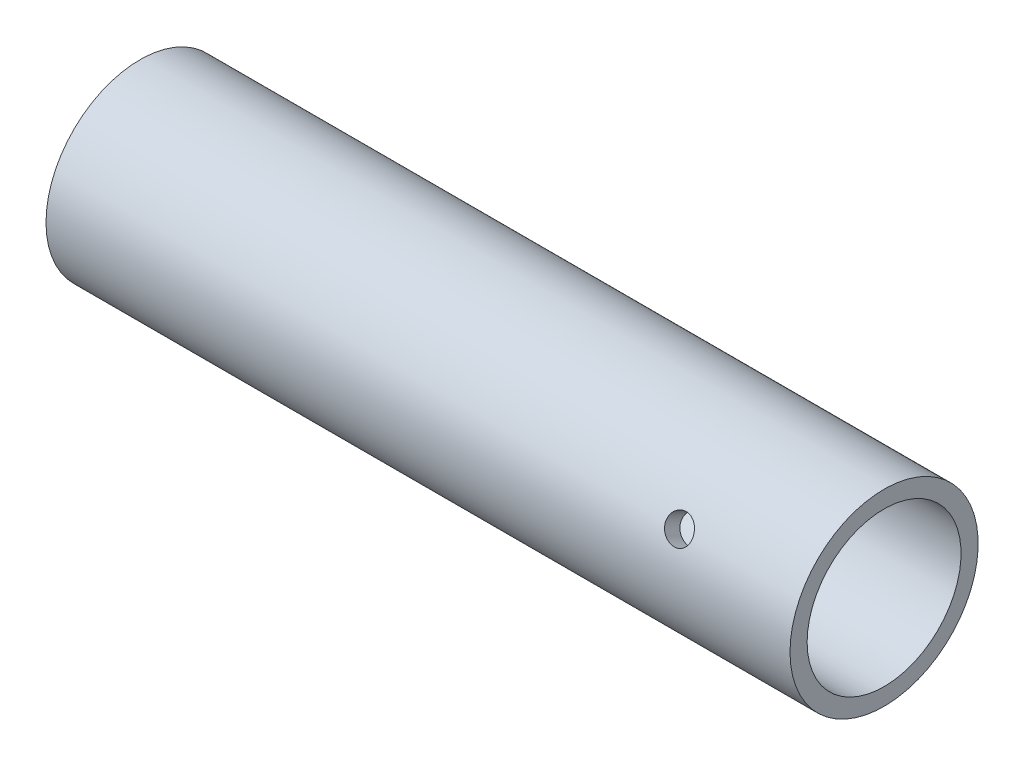
ISO-10303-21;
HEADER;
FILE_DESCRIPTION(('STEP AP214'),'2;1');
FILE_NAME('part.step','',(''),(''),'','','');
FILE_SCHEMA(('AUTOMOTIVE_DESIGN { 1 0 10303 214 1 1 1 1 }'));
ENDSEC;
DATA;
#1=APPLICATION_CONTEXT('core data for automotive mechanical design processes');
#2=APPLICATION_PROTOCOL_DEFINITION('international standard','automotive_design',2000,#1);
#3=PRODUCT_CONTEXT('',#1,'mechanical');
#4=PRODUCT('Part','Part','',(#3));
#5=PRODUCT_RELATED_PRODUCT_CATEGORY('part','',(#4));
#6=PRODUCT_DEFINITION_FORMATION('','',#4);
#7=PRODUCT_DEFINITION_CONTEXT('part definition',#1,'design');
#8=PRODUCT_DEFINITION('design','',#6,#7);
#9=PRODUCT_DEFINITION_SHAPE('','',#8);
#10=(LENGTH_UNIT() NAMED_UNIT(*) SI_UNIT(.MILLI.,.METRE.));
#11=(NAMED_UNIT(*) PLANE_ANGLE_UNIT() SI_UNIT($,.RADIAN.));
#12=(NAMED_UNIT(*) SI_UNIT($,.STERADIAN.) SOLID_ANGLE_UNIT());
#13=UNCERTAINTY_MEASURE_WITH_UNIT(LENGTH_MEASURE(1.E-05),#10,'distance_accuracy_value','');
#14=(GEOMETRIC_REPRESENTATION_CONTEXT(3) GLOBAL_UNCERTAINTY_ASSIGNED_CONTEXT((#13)) GLOBAL_UNIT_ASSIGNED_CONTEXT((#10,
#11,#12)) REPRESENTATION_CONTEXT('',''));
#15=CARTESIAN_POINT('',(0.,0.,0.));
#16=DIRECTION('',(0.,0.,1.));
#17=DIRECTION('',(1.,0.,0.));
#18=AXIS2_PLACEMENT_3D('',#15,#16,#17);
#19=CARTESIAN_POINT('',(261.558388757778,0.,0.));
#20=DIRECTION('',(-1.,0.,0.));
#21=DIRECTION('',(0.,0.,1.));
#22=AXIS2_PLACEMENT_3D('',#19,#20,#21);
#23=PLANE('',#22);
#24=CARTESIAN_POINT('',(261.558388757778,-148.573704322227,0.));
#25=DIRECTION('',(-1.,0.,0.));
#26=DIRECTION('',(0.,0.,1.));
#27=AXIS2_PLACEMENT_3D('',#24,#25,#26);
#28=CIRCLE('',#27,5.50000000000001);
#29=CARTESIAN_POINT('',(261.558388757778,-148.573704322227,5.50000000000001));
#30=VERTEX_POINT('',#29);
#31=EDGE_CURVE('E130',#30,#30,#28,.T.);
#32=ORIENTED_EDGE('',*,*,#31,.T.);
#33=EDGE_LOOP('',(#32));
#34=FACE_BOUND('',#33,.T.);
#35=CARTESIAN_POINT('',(261.558388757778,-148.573704322227,0.));
#36=DIRECTION('',(-1.,0.,0.));
#37=DIRECTION('',(0.,0.,1.));
#38=AXIS2_PLACEMENT_3D('',#35,#36,#37);
#39=CIRCLE('',#38,0.5);
#40=CARTESIAN_POINT('',(261.558388757778,-148.573704322227,0.5));
#41=VERTEX_POINT('',#40);
#42=EDGE_CURVE('E51',#41,#41,#39,.T.);
#43=ORIENTED_EDGE('',*,*,#42,.F.);
#44=EDGE_LOOP('',(#43));
#45=FACE_BOUND('',#44,.T.);
#46=ADVANCED_FACE('F39',(#34,#45),#23,.T.);
#47=CARTESIAN_POINT('',(263.058388757778,-148.573704322227,0.));
#48=DIRECTION('',(-1.,0.,0.));
#49=DIRECTION('',(0.,0.,1.));
#50=AXIS2_PLACEMENT_3D('',#47,#48,#49);
#51=CYLINDRICAL_SURFACE('',#50,0.5);
#52=ORIENTED_EDGE('',*,*,#42,.T.);
#53=EDGE_LOOP('',(#52));
#54=FACE_BOUND('',#53,.T.);
#55=CARTESIAN_POINT('',(263.058388757778,-148.573704322227,0.));
#56=DIRECTION('',(-1.,0.,0.));
#57=DIRECTION('',(0.,0.,1.));
#58=AXIS2_PLACEMENT_3D('',#55,#56,#57);
#59=CIRCLE('',#58,0.5);
#60=CARTESIAN_POINT('',(263.058388757778,-148.573704322227,0.5));
#61=VERTEX_POINT('',#60);
#62=EDGE_CURVE('E55',#61,#61,#59,.T.);
#63=ORIENTED_EDGE('',*,*,#62,.F.);
#64=EDGE_LOOP('',(#63));
#65=FACE_BOUND('',#64,.T.);
#66=ADVANCED_FACE('F102',(#54,#65),#51,.F.);
#67=CARTESIAN_POINT('',(263.058388757778,0.,0.));
#68=DIRECTION('',(-1.,0.,0.));
#69=DIRECTION('',(0.,0.,1.));
#70=AXIS2_PLACEMENT_3D('',#67,#68,#69);
#71=PLANE('',#70);
#72=CARTESIAN_POINT('',(263.058388757778,-148.573704322227,0.));
#73=DIRECTION('',(-1.,0.,0.));
#74=DIRECTION('',(0.,0.,1.));
#75=AXIS2_PLACEMENT_3D('',#72,#73,#74);
#76=CIRCLE('',#75,4.);
#77=CARTESIAN_POINT('',(263.058388757778,-148.573704322227,4.));
#78=VERTEX_POINT('',#77);
#79=EDGE_CURVE('E115',#78,#78,#76,.T.);
#80=ORIENTED_EDGE('',*,*,#79,.F.);
#81=EDGE_LOOP('',(#80));
#82=FACE_BOUND('',#81,.T.);
#83=ORIENTED_EDGE('',*,*,#62,.T.);
#84=EDGE_LOOP('',(#83));
#85=FACE_BOUND('',#84,.T.);
#86=ADVANCED_FACE('F99',(#82,#85),#71,.F.);
#87=CARTESIAN_POINT('',(263.058388757778,-148.573704322227,0.));
#88=DIRECTION('',(-1.,0.,0.));
#89=DIRECTION('',(0.,0.,1.));
#90=AXIS2_PLACEMENT_3D('',#87,#88,#89);
#91=CYLINDRICAL_SURFACE('',#90,4.);
#92=CARTESIAN_POINT('',(295.058388757778,-148.573704322227,0.));
#93=DIRECTION('',(-1.,0.,0.));
#94=DIRECTION('',(0.,0.,1.));
#95=AXIS2_PLACEMENT_3D('',#92,#93,#94);
#96=CIRCLE('',#95,4.);
#97=CARTESIAN_POINT('',(295.058388757778,-148.573704322227,4.));
#98=VERTEX_POINT('',#97);
#99=EDGE_CURVE('E117',#98,#98,#96,.T.);
#100=ORIENTED_EDGE('',*,*,#99,.F.);
#101=EDGE_LOOP('',(#100));
#102=FACE_BOUND('',#101,.T.);
#103=ORIENTED_EDGE('',*,*,#79,.T.);
#104=EDGE_LOOP('',(#103));
#105=FACE_BOUND('',#104,.T.);
#106=ADVANCED_FACE('F95',(#102,#105),#91,.F.);
#107=CARTESIAN_POINT('',(295.058388757778,0.,0.));
#108=DIRECTION('',(-1.,0.,0.));
#109=DIRECTION('',(0.,0.,1.));
#110=AXIS2_PLACEMENT_3D('',#107,#108,#109);
#111=PLANE('',#110);
#112=CARTESIAN_POINT('',(295.058388757778,-148.573704322227,0.));
#113=DIRECTION('',(-1.,0.,0.));
#114=DIRECTION('',(0.,0.,1.));
#115=AXIS2_PLACEMENT_3D('',#112,#113,#114);
#116=CIRCLE('',#115,4.5);
#117=CARTESIAN_POINT('',(295.058388757778,-148.573704322227,4.5));
#118=VERTEX_POINT('',#117);
#119=EDGE_CURVE('E122',#118,#118,#116,.T.);
#120=ORIENTED_EDGE('',*,*,#119,.F.);
#121=EDGE_LOOP('',(#120));
#122=FACE_BOUND('',#121,.T.);
#123=ORIENTED_EDGE('',*,*,#99,.T.);
#124=EDGE_LOOP('',(#123));
#125=FACE_BOUND('',#124,.T.);
#126=ADVANCED_FACE('F90',(#122,#125),#111,.F.);
#127=CARTESIAN_POINT('',(263.058388757778,-148.573704322227,0.));
#128=DIRECTION('',(-1.,0.,0.));
#129=DIRECTION('',(0.,0.,1.));
#130=AXIS2_PLACEMENT_3D('',#127,#128,#129);
#131=CYLINDRICAL_SURFACE('',#130,4.5);
#132=CARTESIAN_POINT('',(298.024345503325,-151.243901459257,-3.62216057752752));
#133=CARTESIAN_POINT('',(297.979791781199,-151.24390025775,-3.62216210114015));
#134=CARTESIAN_POINT('',(297.935214846293,-151.240848975225,-3.62441695078067));
#135=CARTESIAN_POINT('',(297.847314947584,-151.228706225954,-3.63332071635518));
#136=CARTESIAN_POINT('',(297.803993127388,-151.219609420882,-3.63997351574485));
#137=CARTESIAN_POINT('',(297.719888139272,-151.1955879936,-3.65731375261388));
#138=CARTESIAN_POINT('',(297.679102760693,-151.180668531109,-3.66799761770595));
#139=CARTESIAN_POINT('',(297.601151283677,-151.145327213935,-3.69286073185263));
#140=CARTESIAN_POINT('',(297.563984843519,-151.124905879459,-3.70703965043615));
#141=CARTESIAN_POINT('',(297.493906464566,-151.07875919164,-3.73837981269519));
#142=CARTESIAN_POINT('',(297.461040939221,-151.05298269161,-3.75556954366251));
#143=CARTESIAN_POINT('',(297.400901110786,-150.996807902518,-3.79205599158594));
#144=CARTESIAN_POINT('',(297.373627157271,-150.9664093247,-3.81135284015922));
#145=CARTESIAN_POINT('',(297.325268546323,-150.901449921466,-3.85137162004821));
#146=CARTESIAN_POINT('',(297.304227384086,-150.866862114511,-3.87210237565137));
#147=CARTESIAN_POINT('',(297.269211545301,-150.794536373949,-3.91403246064475));
#148=CARTESIAN_POINT('',(297.255236346423,-150.756798673429,-3.93523175527869));
#149=CARTESIAN_POINT('',(297.234891924187,-150.679577209402,-3.97708524162272));
#150=CARTESIAN_POINT('',(297.228444573471,-150.640115872607,-3.99774281701715));
#151=CARTESIAN_POINT('',(297.223095666577,-150.560184827746,-4.03805620880223));
#152=CARTESIAN_POINT('',(297.224193530125,-150.519715197464,-4.05771210211133));
#153=CARTESIAN_POINT('',(297.2338434835,-150.439408378284,-4.09525235934867));
#154=CARTESIAN_POINT('',(297.242311471016,-150.399569200209,-4.11315418364266));
#155=CARTESIAN_POINT('',(297.266328563301,-150.321234582551,-4.14704237490519));
#156=CARTESIAN_POINT('',(297.281877906336,-150.282739188229,-4.16302867739918));
#157=CARTESIAN_POINT('',(297.319698105475,-150.20804926549,-4.19291600356479));
#158=CARTESIAN_POINT('',(297.342003077499,-150.171867571577,-4.20680589404191));
#159=CARTESIAN_POINT('',(297.392676311863,-150.103119338446,-4.23228494524259));
#160=CARTESIAN_POINT('',(297.421045130568,-150.07055313137,-4.24387389466338));
#161=CARTESIAN_POINT('',(297.48350568974,-150.009629205228,-4.26487681986434));
#162=CARTESIAN_POINT('',(297.517670977981,-149.981335738339,-4.27425858713246));
#163=CARTESIAN_POINT('',(297.59050830587,-149.930441029379,-4.29068559718337));
#164=CARTESIAN_POINT('',(297.629180398978,-149.907839854841,-4.29773081224593));
#165=CARTESIAN_POINT('',(297.710023109109,-149.86909151628,-4.30956901037885));
#166=CARTESIAN_POINT('',(297.752198565268,-149.852953464854,-4.31435881512193));
#167=CARTESIAN_POINT('',(297.838800312918,-149.827778263383,-4.32174413454549));
#168=CARTESIAN_POINT('',(297.883226376477,-149.818740395784,-4.32433987096323));
#169=CARTESIAN_POINT('',(297.972422579292,-149.808186676732,-4.32736449058495));
#170=CARTESIAN_POINT('',(298.017179870536,-149.806570424851,-4.32782229738731));
#171=CARTESIAN_POINT('',(298.106331148763,-149.810648744704,-4.32665839042377));
#172=CARTESIAN_POINT('',(298.150725151722,-149.816342993225,-4.32503676859416));
#173=CARTESIAN_POINT('',(298.237556990384,-149.834754994651,-4.31970381148003));
#174=CARTESIAN_POINT('',(298.28000676118,-149.847421059303,-4.3160078511911));
#175=CARTESIAN_POINT('',(298.362125737379,-149.879279222477,-4.30647755916957));
#176=CARTESIAN_POINT('',(298.401794755925,-149.898471759048,-4.30064308390054));
#177=CARTESIAN_POINT('',(298.477681589769,-149.942951936677,-4.28668961722373));
#178=CARTESIAN_POINT('',(298.513859077217,-149.968301083657,-4.2785474247208));
#179=CARTESIAN_POINT('',(298.581317261664,-150.024143435527,-4.25994019733975));
#180=CARTESIAN_POINT('',(298.612597564331,-150.054637054251,-4.2494749755701));
#181=CARTESIAN_POINT('',(298.669753584928,-150.12018884189,-4.22606305444826));
#182=CARTESIAN_POINT('',(298.695560396243,-150.155297112135,-4.21308824852935));
#183=CARTESIAN_POINT('',(298.74055232718,-150.228676613403,-4.18480711142089));
#184=CARTESIAN_POINT('',(298.759737682938,-150.266947731573,-4.1695008634032));
#185=CARTESIAN_POINT('',(298.790836980022,-150.34526713958,-4.13682912458866));
#186=CARTESIAN_POINT('',(298.80278582338,-150.38530588353,-4.11947400825897));
#187=CARTESIAN_POINT('',(298.819184806013,-150.466102445717,-4.08298820350891));
#188=CARTESIAN_POINT('',(298.823635651249,-150.506860195892,-4.06385768242769));
#189=CARTESIAN_POINT('',(298.824889760393,-150.587312380045,-4.02459426092374));
#190=CARTESIAN_POINT('',(298.821797461379,-150.627013727896,-4.00447878533851));
#191=CARTESIAN_POINT('',(298.808280428933,-150.704812608853,-3.96362315781472));
#192=CARTESIAN_POINT('',(298.797855751076,-150.742910154114,-3.94288301061208));
#193=CARTESIAN_POINT('',(298.77001203419,-150.816444274091,-3.90152483193817));
#194=CARTESIAN_POINT('',(298.752603043849,-150.851884585331,-3.8809066680258));
#195=CARTESIAN_POINT('',(298.711296947326,-150.919305899099,-3.84053370907949));
#196=CARTESIAN_POINT('',(298.687399466409,-150.951286701679,-3.82077896398788));
#197=CARTESIAN_POINT('',(298.63343005709,-151.011456336885,-3.78267781118496));
#198=CARTESIAN_POINT('',(298.603282168731,-151.039590693144,-3.764352957311));
#199=CARTESIAN_POINT('',(298.537826318455,-151.09096155591,-3.73019705033898));
#200=CARTESIAN_POINT('',(298.502517148168,-151.11419691233,-3.71436658304057));
#201=CARTESIAN_POINT('',(298.427396412234,-151.155433223478,-3.6858257838361));
#202=CARTESIAN_POINT('',(298.387550367734,-151.17338978907,-3.6731420441212));
#203=CARTESIAN_POINT('',(298.304729692229,-151.203400640516,-3.65171741905032));
#204=CARTESIAN_POINT('',(298.261758144609,-151.21546065512,-3.6429727074143));
#205=CARTESIAN_POINT('',(298.186257265358,-151.230903956832,-3.63171471776848));
#206=CARTESIAN_POINT('',(298.154177563433,-151.235771853139,-3.62814178619092));
#207=CARTESIAN_POINT('',(298.089517875242,-151.242271007287,-3.62336418551826));
#208=CARTESIAN_POINT('',(298.056937900287,-151.243902338197,-3.62215946295875));
#209=CARTESIAN_POINT('',(298.024345503325,-151.243901459257,-3.62216057752752));
#210=B_SPLINE_CURVE_WITH_KNOTS('',3,(#132,#133,#134,#135,#136,#137,#138,#139,#140,#141,#142,
#143,#144,#145,#146,#147,#148,#149,#150,#151,#152,#153,#154,#155,#156,#157,#158,#159,#160,#161,
#162,#163,#164,#165,#166,#167,#168,#169,#170,#171,#172,#173,#174,#175,#176,#177,#178,#179,#180,
#181,#182,#183,#184,#185,#186,#187,#188,#189,#190,#191,#192,#193,#194,#195,#196,#197,#198,#199,
#200,#201,#202,#203,#204,#205,#206,#207,#208,#209),.UNSPECIFIED.,.T.,.F.,(4,2,2,2,2,2,2,2,2,2,2,
2,2,2,2,2,2,2,2,2,2,2,2,2,2,2,2,2,2,2,2,2,2,2,2,2,2,2,4),(0.,0.133541937414479,
0.267201952157879,0.40074379267473,0.534273011124951,0.669141576293385,0.80401857059909,
0.939815747099054,1.07560288373579,1.20996786915373,1.34432252118487,1.4771638273651,
1.61000960359648,1.74353776478289,1.87707818262098,2.0124607557353,2.14784493493399,
2.28341933092325,2.41898002383352,2.55270132678981,2.68641671782542,2.81915385613851,
2.95189990535771,3.0860310049729,3.22017289956884,3.35591462618018,3.49165151147587,
3.62672840692522,3.76179258373143,3.89499739667982,4.02820119999221,4.16121403952693,
4.29423456270357,4.42897790590449,4.5637528461869,4.6996306534586,4.83537618605278,
4.9330683628565,5.03075833414773),.UNSPECIFIED.);
#211=CARTESIAN_POINT('',(298.024345503325,-151.243901459257,-3.62216057752752));
#212=VERTEX_POINT('',#211);
#213=EDGE_CURVE('E80',#212,#212,#210,.T.);
#214=ORIENTED_EDGE('',*,*,#213,.T.);
#215=EDGE_LOOP('',(#214));
#216=FACE_BOUND('',#215,.T.);
#217=CARTESIAN_POINT('',(298.024345503325,-147.339654264115,4.32748431008969));
#218=CARTESIAN_POINT('',(298.06889922545,-147.339652323846,4.32748429070652));
#219=CARTESIAN_POINT('',(298.113476160356,-147.336002533499,4.32644809460398));
#220=CARTESIAN_POINT('',(298.201376059065,-147.321533016187,4.32228198490324));
#221=CARTESIAN_POINT('',(298.244697879261,-147.310706952443,4.31915022085724));
#222=CARTESIAN_POINT('',(298.328802867377,-147.282299156666,4.31074130163626));
#223=CARTESIAN_POINT('',(298.369588245956,-147.264723406056,4.30546604573649));
#224=CARTESIAN_POINT('',(298.447539722972,-147.223441930096,4.29269800410116));
#225=CARTESIAN_POINT('',(298.48470616313,-147.199736784294,4.28520542800853));
#226=CARTESIAN_POINT('',(298.554784542083,-147.146723809402,4.26784607720977));
#227=CARTESIAN_POINT('',(298.587650067428,-147.117362168289,4.25795624224106));
#228=CARTESIAN_POINT('',(298.647789895863,-147.054145992585,4.23580713524086));
#229=CARTESIAN_POINT('',(298.675063849378,-147.020291177307,4.22354771516079));
#230=CARTESIAN_POINT('',(298.723422460326,-146.94890922561,4.19660622700057));
#231=CARTESIAN_POINT('',(298.744463622563,-146.911358610987,4.18190820130683));
#232=CARTESIAN_POINT('',(298.779479461348,-146.833960761945,4.15030570553423));
#233=CARTESIAN_POINT('',(298.793454660226,-146.794113697526,4.13340139866427));
#234=CARTESIAN_POINT('',(298.813799082462,-146.713783502114,4.09787776525641));
#235=CARTESIAN_POINT('',(298.820246433178,-146.673311403788,4.07927825504744));
#236=CARTESIAN_POINT('',(298.825595340072,-146.592543505023,4.04066882590374));
#237=CARTESIAN_POINT('',(298.824497476524,-146.552247691265,4.02065901554701));
#238=CARTESIAN_POINT('',(298.814847523149,-146.473444630373,3.98005687626596));
#239=CARTESIAN_POINT('',(298.806379535633,-146.434922349628,3.95947364743754));
#240=CARTESIAN_POINT('',(298.782362443348,-146.360215100631,3.91819957836307));
#241=CARTESIAN_POINT('',(298.766813100313,-146.324030211071,3.89750873451924));
#242=CARTESIAN_POINT('',(298.728992901174,-146.25471726811,3.85667305450607));
#243=CARTESIAN_POINT('',(298.70668792915,-146.221605871419,3.83653156893396));
#244=CARTESIAN_POINT('',(298.656014694786,-146.159413895389,3.79770297475194));
#245=CARTESIAN_POINT('',(298.627645876081,-146.130333686319,3.7790159998101));
#246=CARTESIAN_POINT('',(298.565185316909,-146.076467296293,3.74364285082579));
#247=CARTESIAN_POINT('',(298.531020028668,-146.051745884148,3.72698783334538));
#248=CARTESIAN_POINT('',(298.458182700779,-146.007632005243,3.69675401540545));
#249=CARTESIAN_POINT('',(298.419510607671,-145.988239601703,3.68317525144237));
#250=CARTESIAN_POINT('',(298.338667897541,-145.955182745778,3.65974832350551));
#251=CARTESIAN_POINT('',(298.296492441381,-145.94152637953,3.64990542788573));
#252=CARTESIAN_POINT('',(298.209890693731,-145.920291216801,3.63449758650598));
#253=CARTESIAN_POINT('',(298.165464630172,-145.912711806174,3.62893220845604));
#254=CARTESIAN_POINT('',(298.076268427357,-145.90386628746,3.62242943148281));
#255=CARTESIAN_POINT('',(298.031511136113,-145.902515911166,3.62143026128845));
#256=CARTESIAN_POINT('',(297.942359857886,-145.905930238048,3.6239461595755));
#257=CARTESIAN_POINT('',(297.897965854927,-145.910694670873,3.62746102848093));
#258=CARTESIAN_POINT('',(297.811134016265,-145.926171031835,3.63877139892073));
#259=CARTESIAN_POINT('',(297.768684245469,-145.936839193493,3.64653539551156));
#260=CARTESIAN_POINT('',(297.686565269271,-145.963857393522,3.6659205933196));
#261=CARTESIAN_POINT('',(297.646896250724,-145.980207813281,3.6775420534436));
#262=CARTESIAN_POINT('',(297.57100941688,-146.018442738012,3.70421181094224));
#263=CARTESIAN_POINT('',(297.534831929432,-146.04038320473,3.71929459820259));
#264=CARTESIAN_POINT('',(297.467373744985,-146.089247138249,3.75211095348777));
#265=CARTESIAN_POINT('',(297.436093442318,-146.116171005944,3.76984473475191));
#266=CARTESIAN_POINT('',(297.378937421721,-146.174773002231,3.80740749482772));
#267=CARTESIAN_POINT('',(297.353130610406,-146.20650400248,3.82725893939429));
#268=CARTESIAN_POINT('',(297.308138679469,-146.273744745487,3.86803952794201));
#269=CARTESIAN_POINT('',(297.288953323711,-146.309254353434,3.88896863346106));
#270=CARTESIAN_POINT('',(297.257854026627,-146.382989644886,3.93097433524505));
#271=CARTESIAN_POINT('',(297.245905183269,-146.421201282582,3.95204971956997));
#272=CARTESIAN_POINT('',(297.229506200636,-146.49946928624,3.99368405651498));
#273=CARTESIAN_POINT('',(297.2250553554,-146.539525478166,4.01424305757468));
#274=CARTESIAN_POINT('',(297.223801246256,-146.619781060647,4.05390679017464));
#275=CARTESIAN_POINT('',(297.22689354527,-146.659970888521,4.07302764566471));
#276=CARTESIAN_POINT('',(297.240410577716,-146.739864411808,4.10961826079321));
#277=CARTESIAN_POINT('',(297.250835255573,-146.779568110903,4.12708803294515));
#278=CARTESIAN_POINT('',(297.278678972459,-146.85725210639,4.15999642988603));
#279=CARTESIAN_POINT('',(297.2960879628,-146.895234791886,4.17543793066553));
#280=CARTESIAN_POINT('',(297.337394059323,-146.968402099488,4.20411116666434));
#281=CARTESIAN_POINT('',(297.36129154024,-147.003586559833,4.21734277418243));
#282=CARTESIAN_POINT('',(297.415260949559,-147.070522777565,4.24166612924499));
#283=CARTESIAN_POINT('',(297.445408837918,-147.102224174256,4.2527279428172));
#284=CARTESIAN_POINT('',(297.510864688194,-147.160659194386,4.27250014412748));
#285=CARTESIAN_POINT('',(297.546173858481,-147.187391651148,4.28120997985196));
#286=CARTESIAN_POINT('',(297.621294594415,-147.235187382921,4.29639479465483));
#287=CARTESIAN_POINT('',(297.661140638915,-147.256202476807,4.30285090261327));
#288=CARTESIAN_POINT('',(297.74396131442,-147.291504108671,4.31350268892641));
#289=CARTESIAN_POINT('',(297.786932862041,-147.305797176866,4.31770056165167));
#290=CARTESIAN_POINT('',(297.862433741291,-147.324147515383,4.32303937940339));
#291=CARTESIAN_POINT('',(297.894513443216,-147.32995096436,4.32470738254479));
#292=CARTESIAN_POINT('',(297.959173131407,-147.337705004919,4.32692984240827));
#293=CARTESIAN_POINT('',(297.991753106362,-147.339655683479,4.32748432426907));
#294=CARTESIAN_POINT('',(298.024345503325,-147.339654264115,4.32748431008969));
#295=B_SPLINE_CURVE_WITH_KNOTS('',3,(#217,#218,#219,#220,#221,#222,#223,#224,#225,#226,#227,
#228,#229,#230,#231,#232,#233,#234,#235,#236,#237,#238,#239,#240,#241,#242,#243,#244,#245,#246,
#247,#248,#249,#250,#251,#252,#253,#254,#255,#256,#257,#258,#259,#260,#261,#262,#263,#264,#265,
#266,#267,#268,#269,#270,#271,#272,#273,#274,#275,#276,#277,#278,#279,#280,#281,#282,#283,#284,
#285,#286,#287,#288,#289,#290,#291,#292,#293,#294),.UNSPECIFIED.,.T.,.F.,(4,2,2,2,2,2,2,2,2,2,2,
2,2,2,2,2,2,2,2,2,2,2,2,2,2,2,2,2,2,2,2,2,2,2,2,2,2,2,4),(0.,0.133541937414477,
0.267201952157882,0.400743792674734,0.534273011124904,0.669141576293382,0.804018570599103,
0.939815747099061,1.07560288373582,1.20996786915377,1.34432252118485,1.47716382736509,
1.61000960359647,1.74353776478282,1.87707818262096,2.01246075573523,2.14784493493393,
2.28341933092319,2.41898002383358,2.55270132678981,2.68641671782542,2.81915385613845,
2.95189990535772,3.08603100497283,3.22017289956881,3.35591462618017,3.49165151147588,
3.62672840692524,3.76179258373143,3.89499739667981,4.02820119999222,4.16121403952694,
4.2942345627036,4.42897790590455,4.5637528461869,4.6996306534586,4.83537618605277,
4.93306836285644,5.03075833414772),.UNSPECIFIED.);
#296=CARTESIAN_POINT('',(298.024345503325,-147.339654264115,4.32748431008969));
#297=VERTEX_POINT('',#296);
#298=EDGE_CURVE('E74',#297,#297,#295,.T.);
#299=ORIENTED_EDGE('',*,*,#298,.T.);
#300=EDGE_LOOP('',(#299));
#301=FACE_BOUND('',#300,.T.);
#302=CARTESIAN_POINT('',(305.058388757778,-148.573704322227,0.));
#303=DIRECTION('',(-1.,0.,0.));
#304=DIRECTION('',(0.,0.,1.));
#305=AXIS2_PLACEMENT_3D('',#302,#303,#304);
#306=CIRCLE('',#305,4.5);
#307=CARTESIAN_POINT('',(305.058388757778,-148.573704322227,4.5));
#308=VERTEX_POINT('',#307);
#309=EDGE_CURVE('E125',#308,#308,#306,.T.);
#310=ORIENTED_EDGE('',*,*,#309,.F.);
#311=EDGE_LOOP('',(#310));
#312=FACE_BOUND('',#311,.T.);
#313=ORIENTED_EDGE('',*,*,#119,.T.);
#314=EDGE_LOOP('',(#313));
#315=FACE_BOUND('',#314,.T.);
#316=ADVANCED_FACE('F85',(#216,#301,#312,#315),#131,.F.);
#317=CARTESIAN_POINT('',(305.058388757778,0.,0.));
#318=DIRECTION('',(-1.,0.,0.));
#319=DIRECTION('',(0.,0.,1.));
#320=AXIS2_PLACEMENT_3D('',#317,#318,#319);
#321=PLANE('',#320);
#322=CARTESIAN_POINT('',(305.058388757778,-148.573704322227,0.));
#323=DIRECTION('',(-1.,0.,0.));
#324=DIRECTION('',(0.,0.,1.));
#325=AXIS2_PLACEMENT_3D('',#322,#323,#324);
#326=CIRCLE('',#325,5.50000000000001);
#327=CARTESIAN_POINT('',(305.058388757778,-148.573704322227,5.50000000000001));
#328=VERTEX_POINT('',#327);
#329=EDGE_CURVE('E128',#328,#328,#326,.T.);
#330=ORIENTED_EDGE('',*,*,#329,.F.);
#331=EDGE_LOOP('',(#330));
#332=FACE_BOUND('',#331,.T.);
#333=ORIENTED_EDGE('',*,*,#309,.T.);
#334=EDGE_LOOP('',(#333));
#335=FACE_BOUND('',#334,.T.);
#336=ADVANCED_FACE('F89',(#332,#335),#321,.F.);
#337=CARTESIAN_POINT('',(263.058388757778,-148.573704322227,0.));
#338=DIRECTION('',(-1.,0.,0.));
#339=DIRECTION('',(0.,0.,1.));
#340=AXIS2_PLACEMENT_3D('',#337,#338,#339);
#341=CYLINDRICAL_SURFACE('',#340,5.50000000000001);
#342=CARTESIAN_POINT('',(298.024345503325,-151.69054294274,-4.53159100247132));
#343=CARTESIAN_POINT('',(297.979664913521,-151.690541597363,-4.53159247547239));
#344=CARTESIAN_POINT('',(297.934957998065,-151.687416967613,-4.53374596947425));
#345=CARTESIAN_POINT('',(297.846792999225,-151.674983413966,-4.54225963448631));
#346=CARTESIAN_POINT('',(297.803336195272,-151.66566837405,-4.54862396570401));
#347=CARTESIAN_POINT('',(297.718960409613,-151.641077487936,-4.56524266941728));
#348=CARTESIAN_POINT('',(297.678039550936,-151.62580611287,-4.57549412387833));
#349=CARTESIAN_POINT('',(297.599843197099,-151.589654969814,-4.59940312937719));
#350=CARTESIAN_POINT('',(297.562567177609,-151.568776010131,-4.61306018949337));
#351=CARTESIAN_POINT('',(297.49243162268,-151.521721293023,-4.64327262647578));
#352=CARTESIAN_POINT('',(297.459603533293,-151.495510798355,-4.65984690963753));
#353=CARTESIAN_POINT('',(297.399568047933,-151.438483598725,-4.69512103945924));
#354=CARTESIAN_POINT('',(297.372360955094,-151.407666645496,-4.71382100067043));
#355=CARTESIAN_POINT('',(297.32422431611,-151.342009798499,-4.75267758705276));
#356=CARTESIAN_POINT('',(297.303323639665,-151.307152385465,-4.77284040232182));
#357=CARTESIAN_POINT('',(297.26857832222,-151.234407730224,-4.81377161162769));
#358=CARTESIAN_POINT('',(297.25473333016,-151.196520638869,-4.83453997548066));
#359=CARTESIAN_POINT('',(297.234587474096,-151.119005245111,-4.87579288741286));
#360=CARTESIAN_POINT('',(297.228234011387,-151.079391132527,-4.89627840402616));
#361=CARTESIAN_POINT('',(297.223088303458,-150.999280165023,-4.93645512466531));
#362=CARTESIAN_POINT('',(297.224295661821,-150.958783356494,-4.95614637028062));
#363=CARTESIAN_POINT('',(297.234195689467,-150.87838759484,-4.99403602022833));
#364=CARTESIAN_POINT('',(297.242831774782,-150.838486436328,-5.01224457322921));
#365=CARTESIAN_POINT('',(297.267255362249,-150.760140645507,-5.04691316601595));
#366=CARTESIAN_POINT('',(297.283043039443,-150.721696048874,-5.06337316299198));
#367=CARTESIAN_POINT('',(297.321380019034,-150.647274542202,-5.09430446352803));
#368=CARTESIAN_POINT('',(297.343953271629,-150.611306936894,-5.1087684537407));
#369=CARTESIAN_POINT('',(297.395203157493,-150.543079003792,-5.13545591652953));
#370=CARTESIAN_POINT('',(297.423880168863,-150.510818905852,-5.14767925021967));
#371=CARTESIAN_POINT('',(297.486839090775,-150.450726099406,-5.16989623768477));
#372=CARTESIAN_POINT('',(297.521170387834,-150.422937099432,-5.17986822354139));
#373=CARTESIAN_POINT('',(297.594295190195,-150.373052527922,-5.19740775875844));
#374=CARTESIAN_POINT('',(297.633088719959,-150.350956987597,-5.20497529493733));
#375=CARTESIAN_POINT('',(297.714086187334,-150.313191577386,-5.21771823094098));
#376=CARTESIAN_POINT('',(297.756292498613,-150.297526226667,-5.22289194870274));
#377=CARTESIAN_POINT('',(297.842890837152,-150.273197328869,-5.23085929299254));
#378=CARTESIAN_POINT('',(297.887282719798,-150.264533319184,-5.23365307677327));
#379=CARTESIAN_POINT('',(297.976558659285,-150.254566963402,-5.23686245455308));
#380=CARTESIAN_POINT('',(298.021434538307,-150.253198216583,-5.23729949977115));
#381=CARTESIAN_POINT('',(298.110783825498,-150.257693125984,-5.2358559055564));
#382=CARTESIAN_POINT('',(298.155257245346,-150.263556571626,-5.23397533360439));
#383=CARTESIAN_POINT('',(298.242326604334,-150.28225955346,-5.22789957530814));
#384=CARTESIAN_POINT('',(298.28493035651,-150.295066310711,-5.22371526334911));
#385=CARTESIAN_POINT('',(298.367297026714,-150.327188581418,-5.21302002875177));
#386=CARTESIAN_POINT('',(298.407059812082,-150.346504398579,-5.20650899755115));
#387=CARTESIAN_POINT('',(298.482925953487,-150.391157290087,-5.19109087341733));
#388=CARTESIAN_POINT('',(298.519001348408,-150.416536107261,-5.18216711045141));
#389=CARTESIAN_POINT('',(298.586181643355,-150.472415805754,-5.16195460047192));
#390=CARTESIAN_POINT('',(298.617286279436,-150.50291695889,-5.15066572794553));
#391=CARTESIAN_POINT('',(298.673889059599,-150.568338726295,-5.1256869537263));
#392=CARTESIAN_POINT('',(298.699341513161,-150.603292000346,-5.11197898617881));
#393=CARTESIAN_POINT('',(298.743599523581,-150.676337807377,-5.08236985318229));
#394=CARTESIAN_POINT('',(298.762405253338,-150.714430258667,-5.06646874479747));
#395=CARTESIAN_POINT('',(298.792762506043,-150.79244634189,-5.03279059303883));
#396=CARTESIAN_POINT('',(298.804339286805,-150.83236306905,-5.0150203377012));
#397=CARTESIAN_POINT('',(298.819991851023,-150.912945640527,-4.97794293609399));
#398=CARTESIAN_POINT('',(298.824068099059,-150.953611438288,-4.95863588509033));
#399=CARTESIAN_POINT('',(298.824593067349,-151.034117091573,-4.91918288084775));
#400=CARTESIAN_POINT('',(298.821111801073,-151.073961105694,-4.89904630895697));
#401=CARTESIAN_POINT('',(298.806770283551,-151.152089518023,-4.85838140773908));
#402=CARTESIAN_POINT('',(298.795910051889,-151.190373920369,-4.83785307945175));
#403=CARTESIAN_POINT('',(298.767143185557,-151.264337825379,-4.79711105071926));
#404=CARTESIAN_POINT('',(298.749241112255,-151.300018996591,-4.77689715539307));
#405=CARTESIAN_POINT('',(298.706906143802,-151.367908831213,-4.73750602857751));
#406=CARTESIAN_POINT('',(298.682473062235,-151.400117395468,-4.71832882669756));
#407=CARTESIAN_POINT('',(298.627515277695,-151.460562464795,-4.68159309569492));
#408=CARTESIAN_POINT('',(298.596938787791,-151.488761463174,-4.6640503211196));
#409=CARTESIAN_POINT('',(298.530671017475,-151.540197331105,-4.63150602782409));
#410=CARTESIAN_POINT('',(298.494978536812,-151.563433033035,-4.61650510724945));
#411=CARTESIAN_POINT('',(298.419271848146,-151.604510871814,-4.58964257867961));
#412=CARTESIAN_POINT('',(298.379235881324,-151.622323975551,-4.57779791025326));
#413=CARTESIAN_POINT('',(298.296148960806,-151.65196137448,-4.55792219518786));
#414=CARTESIAN_POINT('',(298.253101219686,-151.66379194347,-4.54988715400178));
#415=CARTESIAN_POINT('',(298.17893600929,-151.678492677575,-4.53986117199829));
#416=CARTESIAN_POINT('',(298.148278664431,-151.683005996056,-4.53676719495362));
#417=CARTESIAN_POINT('',(298.086533629044,-151.689031579172,-4.53263160964414));
#418=CARTESIAN_POINT('',(298.055445943595,-151.690543879205,-4.53158997717192));
#419=CARTESIAN_POINT('',(298.024345503325,-151.69054294274,-4.53159100247132));
#420=B_SPLINE_CURVE_WITH_KNOTS('',3,(#342,#343,#344,#345,#346,#347,#348,#349,#350,#351,#352,
#353,#354,#355,#356,#357,#358,#359,#360,#361,#362,#363,#364,#365,#366,#367,#368,#369,#370,#371,
#372,#373,#374,#375,#376,#377,#378,#379,#380,#381,#382,#383,#384,#385,#386,#387,#388,#389,#390,
#391,#392,#393,#394,#395,#396,#397,#398,#399,#400,#401,#402,#403,#404,#405,#406,#407,#408,#409,
#410,#411,#412,#413,#414,#415,#416,#417,#418,#419),.UNSPECIFIED.,.T.,.F.,(4,2,2,2,2,2,2,2,2,2,2,
2,2,2,2,2,2,2,2,2,2,2,2,2,2,2,2,2,2,2,2,2,2,2,2,2,2,2,4),(0.,0.133928106179127,
0.267988728135679,0.401948910386038,0.535889793286714,0.670733045334241,0.805583567434677,
0.941042359886445,1.0764944118359,1.21098967008443,1.34547787675289,1.47895067867185,
1.61242674764682,1.74637957529159,1.8803407031324,2.01554083613156,2.15074171030415,
2.28603744225787,2.42132423393492,2.55537752982758,2.68942692265472,2.8228489182954,
2.95627714008166,3.09065190383764,3.22503380046684,3.36046536432084,3.49589340499148,
3.63084557533073,3.76578938649318,3.89948840502898,4.03318706875169,4.1667992711333,
4.30041528765269,4.43520884238168,4.57003407262487,4.70556896385402,4.84096142529226,
4.93418472907518,5.02740693328282),.UNSPECIFIED.);
#421=CARTESIAN_POINT('',(298.024345503325,-151.69054294274,-4.53159100247132));
#422=VERTEX_POINT('',#421);
#423=EDGE_CURVE('E42',#422,#422,#420,.T.);
#424=ORIENTED_EDGE('',*,*,#423,.F.);
#425=EDGE_LOOP('',(#424));
#426=FACE_BOUND('',#425,.T.);
#427=CARTESIAN_POINT('',(298.024345503325,-146.893012780632,5.23691473503349));
#428=CARTESIAN_POINT('',(298.069026093128,-146.893010792462,5.23691457085565));
#429=CARTESIAN_POINT('',(298.113733008584,-146.889396371254,5.23575836723264));
#430=CARTESIAN_POINT('',(298.201898007424,-146.875057785225,5.23112363974227));
#431=CARTESIAN_POINT('',(298.245354811377,-146.864326589175,5.22764281917647));
#432=CARTESIAN_POINT('',(298.329730597036,-146.836141655883,5.21834214563498));
#433=CARTESIAN_POINT('',(298.370651455713,-146.818692961268,5.21252404704219));
#434=CARTESIAN_POINT('',(298.44884780955,-146.777671453556,5.19853184946054));
#435=CARTESIAN_POINT('',(298.48612382904,-146.754099523108,5.19035809001626));
#436=CARTESIAN_POINT('',(298.556259383969,-146.701423874861,5.17159072919434));
#437=CARTESIAN_POINT('',(298.589087473356,-146.672283958905,5.16098119616297));
#438=CARTESIAN_POINT('',(298.649122958716,-146.609506055848,5.13741637874327));
#439=CARTESIAN_POINT('',(298.676330051555,-146.575867826318,5.12446096791495));
#440=CARTESIAN_POINT('',(298.724466690539,-146.504979218142,5.09625704808539));
#441=CARTESIAN_POINT('',(298.745367366984,-146.46771323059,5.08099845920076));
#442=CARTESIAN_POINT('',(298.780112684429,-146.390849757555,5.04845379336387));
#443=CARTESIAN_POINT('',(298.793957676489,-146.351252388181,5.0311678173383));
#444=CARTESIAN_POINT('',(298.814103532553,-146.271217775259,4.99504442122517));
#445=CARTESIAN_POINT('',(298.820456995262,-146.230788440085,4.97621882258546));
#446=CARTESIAN_POINT('',(298.825602703191,-146.15001870387,4.93738345587609));
#447=CARTESIAN_POINT('',(298.824395344828,-146.109678298277,4.91737374994414));
#448=CARTESIAN_POINT('',(298.814495317182,-146.030544365518,4.87691482322494));
#449=CARTESIAN_POINT('',(298.805859231867,-145.991741458794,4.85647006148172));
#450=CARTESIAN_POINT('',(298.7814356444,-145.91640979585,4.81566424298381));
#451=CARTESIAN_POINT('',(298.765647967206,-145.879881095319,4.79530318829023));
#452=CARTESIAN_POINT('',(298.727310987615,-145.80990608058,4.75531814958338));
#453=CARTESIAN_POINT('',(298.70473773502,-145.776471242284,4.73569705805899));
#454=CARTESIAN_POINT('',(298.653487849156,-145.713641051812,4.69801896507782));
#455=CARTESIAN_POINT('',(298.624810837786,-145.684245950065,4.67996206061299));
#456=CARTESIAN_POINT('',(298.561851915874,-145.629926891123,4.64598883947756));
#457=CARTESIAN_POINT('',(298.527520618815,-145.605046802069,4.63009386573908));
#458=CARTESIAN_POINT('',(298.454395816454,-145.560670048432,4.60133957028541));
#459=CARTESIAN_POINT('',(298.41560228669,-145.541173413361,4.58848026521229));
#460=CARTESIAN_POINT('',(298.334604819315,-145.508001484447,4.56638429819254));
#461=CARTESIAN_POINT('',(298.292398508036,-145.494330284491,4.55715018424506));
#462=CARTESIAN_POINT('',(298.205800169497,-145.473151908434,4.54276789546123));
#463=CARTESIAN_POINT('',(298.161408286851,-145.465644325077,4.53761945066831));
#464=CARTESIAN_POINT('',(298.072132347364,-145.457011675163,4.53169444359881));
#465=CARTESIAN_POINT('',(298.027256468342,-145.455829039254,4.53087844808369));
#466=CARTESIAN_POINT('',(297.937907181151,-145.459719380052,4.53355303650867));
#467=CARTESIAN_POINT('',(297.893433761303,-145.464792174624,4.53704349506008));
#468=CARTESIAN_POINT('',(297.806364402315,-145.481034251964,4.54813003158246));
#469=CARTESIAN_POINT('',(297.763760650139,-145.492174889951,4.55570681738418));
#470=CARTESIAN_POINT('',(297.681393979935,-145.520276446219,4.57458884200673));
#471=CARTESIAN_POINT('',(297.641631194567,-145.537237636078,4.58589425479954));
#472=CARTESIAN_POINT('',(297.565765053162,-145.57673722842,4.61180528482017));
#473=CARTESIAN_POINT('',(297.529689658241,-145.599314342165,4.62643374480613));
#474=CARTESIAN_POINT('',(297.462509363294,-145.649471473505,4.65829827742542));
#475=CARTESIAN_POINT('',(297.431404727213,-145.6770517566,4.67553448843469));
#476=CARTESIAN_POINT('',(297.37480194705,-145.736814220426,4.71203647097459));
#477=CARTESIAN_POINT('',(297.349349493488,-145.769030664176,4.73131704392558));
#478=CARTESIAN_POINT('',(297.305091483068,-145.837118336643,4.77102169780385));
#479=CARTESIAN_POINT('',(297.286285753311,-145.872989470261,4.79144574897032));
#480=CARTESIAN_POINT('',(297.255928500606,-145.947335767468,4.83259614676907));
#481=CARTESIAN_POINT('',(297.244351719844,-145.985801338053,4.85332117901328));
#482=CARTESIAN_POINT('',(297.228699155626,-146.064406689792,4.89442450264612));
#483=CARTESIAN_POINT('',(297.22462290759,-146.104546367095,4.91480281543298));
#484=CARTESIAN_POINT('',(297.2240979393,-146.184984666884,4.95439296170258));
#485=CARTESIAN_POINT('',(297.227579205576,-146.225278407617,4.97361382137464));
#486=CARTESIAN_POINT('',(297.241920723098,-146.30522245311,5.01058181556286));
#487=CARTESIAN_POINT('',(297.252780954761,-146.344872759577,5.0283289539899));
#488=CARTESIAN_POINT('',(297.281547821092,-146.42233190075,5.06195414690094));
#489=CARTESIAN_POINT('',(297.299449894394,-146.460141909733,5.07783340267741));
#490=CARTESIAN_POINT('',(297.341784862847,-146.532818655385,5.10747764593511));
#491=CARTESIAN_POINT('',(297.366217944414,-146.567685308004,5.12124257304881));
#492=CARTESIAN_POINT('',(297.421175728954,-146.63370936179,5.14661863775123));
#493=CARTESIAN_POINT('',(297.451752218858,-146.664831365907,5.15820972523928));
#494=CARTESIAN_POINT('',(297.518019989174,-146.722030750017,5.17901861740947));
#495=CARTESIAN_POINT('',(297.553712469837,-146.748106942842,5.18823586374716));
#496=CARTESIAN_POINT('',(297.629419158503,-146.794477667216,5.20432126709607));
#497=CARTESIAN_POINT('',(297.669455125325,-146.814741044189,5.21117680416489));
#498=CARTESIAN_POINT('',(297.752542045843,-146.848588613766,5.22247996736714));
#499=CARTESIAN_POINT('',(297.795589786963,-146.862179802959,5.22693011633541));
#500=CARTESIAN_POINT('',(297.869754997359,-146.879101209226,5.23243446991257));
#501=CARTESIAN_POINT('',(297.900412342218,-146.884308861315,5.23411467745303));
#502=CARTESIAN_POINT('',(297.962157377605,-146.891265318564,5.23635486054595));
#503=CARTESIAN_POINT('',(297.993245063054,-146.89301416452,5.23691484931137));
#504=CARTESIAN_POINT('',(298.024345503325,-146.893012780632,5.23691473503349));
#505=B_SPLINE_CURVE_WITH_KNOTS('',3,(#427,#428,#429,#430,#431,#432,#433,#434,#435,#436,#437,
#438,#439,#440,#441,#442,#443,#444,#445,#446,#447,#448,#449,#450,#451,#452,#453,#454,#455,#456,
#457,#458,#459,#460,#461,#462,#463,#464,#465,#466,#467,#468,#469,#470,#471,#472,#473,#474,#475,
#476,#477,#478,#479,#480,#481,#482,#483,#484,#485,#486,#487,#488,#489,#490,#491,#492,#493,#494,
#495,#496,#497,#498,#499,#500,#501,#502,#503,#504),.UNSPECIFIED.,.T.,.F.,(4,2,2,2,2,2,2,2,2,2,2,
2,2,2,2,2,2,2,2,2,2,2,2,2,2,2,2,2,2,2,2,2,2,2,2,2,2,2,4),(0.,0.133928106179184,
0.267988728135742,0.401948910386161,0.535889793286788,0.670733045334318,0.805583567434786,
0.941042359886524,1.07649441183598,1.2109896700845,1.34547787675295,1.47895067867196,
1.6124267476469,1.74637957529161,1.88034070313248,2.01554083613156,2.15074171030421,
2.28603744225799,2.42132423393498,2.55537752982758,2.68942692265479,2.82284891829535,
2.95627714008172,3.09065190383769,3.22503380046694,3.36046536432095,3.49589340499162,
3.63084557533084,3.76578938649327,3.89948840502909,4.03318706875179,4.16679927113338,
4.30041528765275,4.43520884238179,4.57003407262492,4.70556896385401,4.84096142529226,
4.93418472907523,5.02740693328282),.UNSPECIFIED.);
#506=CARTESIAN_POINT('',(298.024345503325,-146.893012780632,5.23691473503349));
#507=VERTEX_POINT('',#506);
#508=EDGE_CURVE('E10',#507,#507,#505,.T.);
#509=ORIENTED_EDGE('',*,*,#508,.F.);
#510=EDGE_LOOP('',(#509));
#511=FACE_BOUND('',#510,.T.);
#512=ORIENTED_EDGE('',*,*,#329,.T.);
#513=EDGE_LOOP('',(#512));
#514=FACE_BOUND('',#513,.T.);
#515=ORIENTED_EDGE('',*,*,#31,.F.);
#516=EDGE_LOOP('',(#515));
#517=FACE_BOUND('',#516,.T.);
#518=ADVANCED_FACE('F61',(#426,#511,#514,#517),#341,.T.);
#519=CARTESIAN_POINT('',(298.024345503325,-151.818769174803,-6.60744874129836));
#520=DIRECTION('',(0.,0.440827332851372,0.897591924323713));
#521=DIRECTION('',(0.,-0.897591924323713,0.440827332851372));
#522=AXIS2_PLACEMENT_3D('',#519,#520,#521);
#523=CYLINDRICAL_SURFACE('',#522,0.800000000000004);
#524=ORIENTED_EDGE('',*,*,#508,.T.);
#525=EDGE_LOOP('',(#524));
#526=FACE_BOUND('',#525,.T.);
#527=ORIENTED_EDGE('',*,*,#298,.F.);
#528=EDGE_LOOP('',(#527));
#529=FACE_BOUND('',#528,.T.);
#530=ADVANCED_FACE('F67',(#526,#529),#523,.F.);
#531=ORIENTED_EDGE('',*,*,#423,.T.);
#532=EDGE_LOOP('',(#531));
#533=FACE_BOUND('',#532,.T.);
#534=ORIENTED_EDGE('',*,*,#213,.F.);
#535=EDGE_LOOP('',(#534));
#536=FACE_BOUND('',#535,.T.);
#537=ADVANCED_FACE('F64',(#533,#536),#523,.F.);
#538=CLOSED_SHELL('',(#46,#66,#86,#106,#126,#316,#336,#518,#530,#537));
#539=MANIFOLD_SOLID_BREP('B2',#538);
#540=ADVANCED_BREP_SHAPE_REPRESENTATION('',(#18,#539),#14);
#541=SHAPE_DEFINITION_REPRESENTATION(#9,#540);
ENDSEC;
END-ISO-10303-21;
